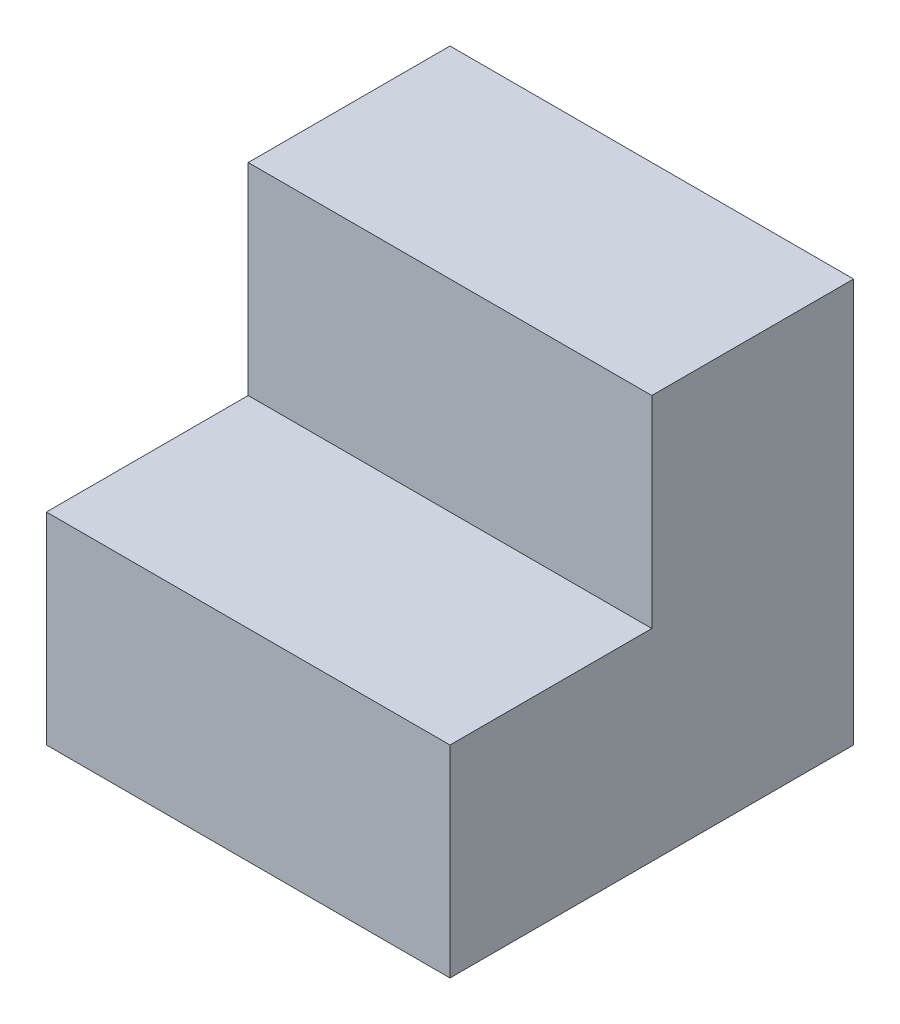
ISO-10303-21;
HEADER;
FILE_DESCRIPTION(('STEP AP214'),'2;1');
FILE_NAME('part.step','',(''),(''),'','','');
FILE_SCHEMA(('AUTOMOTIVE_DESIGN { 1 0 10303 214 1 1 1 1 }'));
ENDSEC;
DATA;
#1=APPLICATION_CONTEXT('core data for automotive mechanical design processes');
#2=APPLICATION_PROTOCOL_DEFINITION('international standard','automotive_design',2000,#1);
#3=PRODUCT_CONTEXT('',#1,'mechanical');
#4=PRODUCT('Part','Part','',(#3));
#5=PRODUCT_RELATED_PRODUCT_CATEGORY('part','',(#4));
#6=PRODUCT_DEFINITION_FORMATION('','',#4);
#7=PRODUCT_DEFINITION_CONTEXT('part definition',#1,'design');
#8=PRODUCT_DEFINITION('design','',#6,#7);
#9=PRODUCT_DEFINITION_SHAPE('','',#8);
#10=(LENGTH_UNIT() NAMED_UNIT(*) SI_UNIT(.MILLI.,.METRE.));
#11=(NAMED_UNIT(*) PLANE_ANGLE_UNIT() SI_UNIT($,.RADIAN.));
#12=(NAMED_UNIT(*) SI_UNIT($,.STERADIAN.) SOLID_ANGLE_UNIT());
#13=UNCERTAINTY_MEASURE_WITH_UNIT(LENGTH_MEASURE(1.E-05),#10,'distance_accuracy_value','');
#14=(GEOMETRIC_REPRESENTATION_CONTEXT(3) GLOBAL_UNCERTAINTY_ASSIGNED_CONTEXT((#13)) GLOBAL_UNIT_ASSIGNED_CONTEXT((#10,
#11,#12)) REPRESENTATION_CONTEXT('',''));
#15=CARTESIAN_POINT('',(0.,0.,0.));
#16=DIRECTION('',(0.,0.,1.));
#17=DIRECTION('',(1.,0.,0.));
#18=AXIS2_PLACEMENT_3D('',#15,#16,#17);
#19=CARTESIAN_POINT('',(0.5,0.,0.499999999999997));
#20=DIRECTION('',(0.,-1.,0.));
#21=DIRECTION('',(0.,0.,-1.));
#22=AXIS2_PLACEMENT_3D('',#19,#20,#21);
#23=PLANE('',#22);
#24=DIRECTION('',(0.,0.,1.));
#25=VECTOR('',#24,1.);
#26=CARTESIAN_POINT('',(-0.5,0.,0.499999999999997));
#27=LINE('',#26,#25);
#28=CARTESIAN_POINT('',(-0.5,0.,0.));
#29=VERTEX_POINT('',#28);
#30=CARTESIAN_POINT('',(-0.5,0.,0.499999999999997));
#31=VERTEX_POINT('',#30);
#32=EDGE_CURVE('E119',#29,#31,#27,.T.);
#33=ORIENTED_EDGE('',*,*,#32,.T.);
#34=DIRECTION('',(-1.,0.,0.));
#35=VECTOR('',#34,1.);
#36=CARTESIAN_POINT('',(0.5,0.,0.499999999999997));
#37=LINE('',#36,#35);
#38=CARTESIAN_POINT('',(0.5,0.,0.499999999999997));
#39=VERTEX_POINT('',#38);
#40=EDGE_CURVE('E11',#39,#31,#37,.T.);
#41=ORIENTED_EDGE('',*,*,#40,.F.);
#42=DIRECTION('',(0.,0.,1.));
#43=VECTOR('',#42,1.);
#44=CARTESIAN_POINT('',(0.5,0.,0.499999999999997));
#45=LINE('',#44,#43);
#46=CARTESIAN_POINT('',(0.5,0.,0.));
#47=VERTEX_POINT('',#46);
#48=EDGE_CURVE('E129',#47,#39,#45,.T.);
#49=ORIENTED_EDGE('',*,*,#48,.F.);
#50=DIRECTION('',(-1.,0.,0.));
#51=VECTOR('',#50,1.);
#52=CARTESIAN_POINT('',(0.5,0.,0.));
#53=LINE('',#52,#51);
#54=EDGE_CURVE('E115',#47,#29,#53,.T.);
#55=ORIENTED_EDGE('',*,*,#54,.T.);
#56=EDGE_LOOP('',(#33,#41,#49,#55));
#57=FACE_BOUND('',#56,.T.);
#58=ADVANCED_FACE('F35',(#57),#23,.F.);
#59=CARTESIAN_POINT('',(0.5,-0.5,0.499999999999997));
#60=DIRECTION('',(0.,0.,-1.));
#61=DIRECTION('',(-1.,0.,0.));
#62=AXIS2_PLACEMENT_3D('',#59,#60,#61);
#63=PLANE('',#62);
#64=DIRECTION('',(0.,-1.,0.));
#65=VECTOR('',#64,1.);
#66=CARTESIAN_POINT('',(-0.5,-0.5,0.499999999999997));
#67=LINE('',#66,#65);
#68=CARTESIAN_POINT('',(-0.5,-0.5,0.499999999999997));
#69=VERTEX_POINT('',#68);
#70=EDGE_CURVE('E122',#31,#69,#67,.T.);
#71=ORIENTED_EDGE('',*,*,#70,.T.);
#72=DIRECTION('',(-1.,0.,0.));
#73=VECTOR('',#72,1.);
#74=CARTESIAN_POINT('',(0.5,-0.5,0.499999999999997));
#75=LINE('',#74,#73);
#76=CARTESIAN_POINT('',(0.5,-0.5,0.499999999999997));
#77=VERTEX_POINT('',#76);
#78=EDGE_CURVE('E43',#77,#69,#75,.T.);
#79=ORIENTED_EDGE('',*,*,#78,.F.);
#80=DIRECTION('',(0.,-1.,0.));
#81=VECTOR('',#80,1.);
#82=CARTESIAN_POINT('',(0.5,-0.5,0.499999999999997));
#83=LINE('',#82,#81);
#84=EDGE_CURVE('E88',#39,#77,#83,.T.);
#85=ORIENTED_EDGE('',*,*,#84,.F.);
#86=ORIENTED_EDGE('',*,*,#40,.T.);
#87=EDGE_LOOP('',(#71,#79,#85,#86));
#88=FACE_BOUND('',#87,.T.);
#89=ADVANCED_FACE('F153',(#88),#63,.F.);
#90=CARTESIAN_POINT('',(0.5,-0.499999999999997,-0.5));
#91=DIRECTION('',(0.,1.,0.));
#92=DIRECTION('',(0.,0.,1.));
#93=AXIS2_PLACEMENT_3D('',#90,#91,#92);
#94=PLANE('',#93);
#95=DIRECTION('',(0.,0.,-1.));
#96=VECTOR('',#95,1.);
#97=CARTESIAN_POINT('',(-0.5,-0.499999999999997,-0.5));
#98=LINE('',#97,#96);
#99=CARTESIAN_POINT('',(-0.5,-0.499999999999997,-0.5));
#100=VERTEX_POINT('',#99);
#101=EDGE_CURVE('E124',#69,#100,#98,.T.);
#102=ORIENTED_EDGE('',*,*,#101,.T.);
#103=DIRECTION('',(-1.,0.,0.));
#104=VECTOR('',#103,1.);
#105=CARTESIAN_POINT('',(0.5,-0.499999999999997,-0.5));
#106=LINE('',#105,#104);
#107=CARTESIAN_POINT('',(0.5,-0.499999999999997,-0.5));
#108=VERTEX_POINT('',#107);
#109=EDGE_CURVE('E110',#108,#100,#106,.T.);
#110=ORIENTED_EDGE('',*,*,#109,.F.);
#111=DIRECTION('',(0.,0.,-1.));
#112=VECTOR('',#111,1.);
#113=CARTESIAN_POINT('',(0.5,-0.499999999999997,-0.5));
#114=LINE('',#113,#112);
#115=EDGE_CURVE('E101',#77,#108,#114,.T.);
#116=ORIENTED_EDGE('',*,*,#115,.F.);
#117=ORIENTED_EDGE('',*,*,#78,.T.);
#118=EDGE_LOOP('',(#102,#110,#116,#117));
#119=FACE_BOUND('',#118,.T.);
#120=ADVANCED_FACE('F135',(#119),#94,.F.);
#121=CARTESIAN_POINT('',(0.5,0.500000000000004,-0.5));
#122=DIRECTION('',(0.,0.,1.));
#123=DIRECTION('',(1.,0.,0.));
#124=AXIS2_PLACEMENT_3D('',#121,#122,#123);
#125=PLANE('',#124);
#126=DIRECTION('',(0.,1.,0.));
#127=VECTOR('',#126,1.);
#128=CARTESIAN_POINT('',(-0.5,0.500000000000004,-0.5));
#129=LINE('',#128,#127);
#130=CARTESIAN_POINT('',(-0.5,0.500000000000004,-0.5));
#131=VERTEX_POINT('',#130);
#132=EDGE_CURVE('E109',#100,#131,#129,.T.);
#133=ORIENTED_EDGE('',*,*,#132,.T.);
#134=DIRECTION('',(-1.,0.,0.));
#135=VECTOR('',#134,1.);
#136=CARTESIAN_POINT('',(0.5,0.500000000000004,-0.5));
#137=LINE('',#136,#135);
#138=CARTESIAN_POINT('',(0.5,0.500000000000004,-0.5));
#139=VERTEX_POINT('',#138);
#140=EDGE_CURVE('E106',#139,#131,#137,.T.);
#141=ORIENTED_EDGE('',*,*,#140,.F.);
#142=DIRECTION('',(0.,1.,0.));
#143=VECTOR('',#142,1.);
#144=CARTESIAN_POINT('',(0.5,0.500000000000004,-0.5));
#145=LINE('',#144,#143);
#146=EDGE_CURVE('E95',#108,#139,#145,.T.);
#147=ORIENTED_EDGE('',*,*,#146,.F.);
#148=ORIENTED_EDGE('',*,*,#109,.T.);
#149=EDGE_LOOP('',(#133,#141,#147,#148));
#150=FACE_BOUND('',#149,.T.);
#151=ADVANCED_FACE('F107',(#150),#125,.F.);
#152=CARTESIAN_POINT('',(0.5,0.500000000000004,0.));
#153=DIRECTION('',(0.,-1.,0.));
#154=DIRECTION('',(0.,0.,-1.));
#155=AXIS2_PLACEMENT_3D('',#152,#153,#154);
#156=PLANE('',#155);
#157=DIRECTION('',(0.,0.,1.));
#158=VECTOR('',#157,1.);
#159=CARTESIAN_POINT('',(-0.5,0.500000000000004,0.));
#160=LINE('',#159,#158);
#161=CARTESIAN_POINT('',(-0.5,0.500000000000004,0.));
#162=VERTEX_POINT('',#161);
#163=EDGE_CURVE('E74',#131,#162,#160,.T.);
#164=ORIENTED_EDGE('',*,*,#163,.T.);
#165=DIRECTION('',(-1.,0.,0.));
#166=VECTOR('',#165,1.);
#167=CARTESIAN_POINT('',(0.5,0.500000000000004,0.));
#168=LINE('',#167,#166);
#169=CARTESIAN_POINT('',(0.5,0.500000000000004,0.));
#170=VERTEX_POINT('',#169);
#171=EDGE_CURVE('E111',#170,#162,#168,.T.);
#172=ORIENTED_EDGE('',*,*,#171,.F.);
#173=DIRECTION('',(0.,0.,1.));
#174=VECTOR('',#173,1.);
#175=CARTESIAN_POINT('',(0.5,0.500000000000004,0.));
#176=LINE('',#175,#174);
#177=EDGE_CURVE('E99',#139,#170,#176,.T.);
#178=ORIENTED_EDGE('',*,*,#177,.F.);
#179=ORIENTED_EDGE('',*,*,#140,.T.);
#180=EDGE_LOOP('',(#164,#172,#178,#179));
#181=FACE_BOUND('',#180,.T.);
#182=ADVANCED_FACE('F113',(#181),#156,.F.);
#183=CARTESIAN_POINT('',(0.5,0.,0.));
#184=DIRECTION('',(0.,0.,-1.));
#185=DIRECTION('',(-1.,0.,0.));
#186=AXIS2_PLACEMENT_3D('',#183,#184,#185);
#187=PLANE('',#186);
#188=DIRECTION('',(0.,-1.,0.));
#189=VECTOR('',#188,1.);
#190=CARTESIAN_POINT('',(-0.5,0.,0.));
#191=LINE('',#190,#189);
#192=EDGE_CURVE('E80',#162,#29,#191,.T.);
#193=ORIENTED_EDGE('',*,*,#192,.T.);
#194=ORIENTED_EDGE('',*,*,#54,.F.);
#195=DIRECTION('',(0.,-1.,0.));
#196=VECTOR('',#195,1.);
#197=CARTESIAN_POINT('',(0.5,0.,0.));
#198=LINE('',#197,#196);
#199=EDGE_CURVE('E51',#170,#47,#198,.T.);
#200=ORIENTED_EDGE('',*,*,#199,.F.);
#201=ORIENTED_EDGE('',*,*,#171,.T.);
#202=EDGE_LOOP('',(#193,#194,#200,#201));
#203=FACE_BOUND('',#202,.T.);
#204=ADVANCED_FACE('F142',(#203),#187,.F.);
#205=CARTESIAN_POINT('',(0.5,0.,0.));
#206=DIRECTION('',(1.,0.,0.));
#207=DIRECTION('',(0.,0.,-1.));
#208=AXIS2_PLACEMENT_3D('',#205,#206,#207);
#209=PLANE('',#208);
#210=ORIENTED_EDGE('',*,*,#48,.T.);
#211=ORIENTED_EDGE('',*,*,#84,.T.);
#212=ORIENTED_EDGE('',*,*,#115,.T.);
#213=ORIENTED_EDGE('',*,*,#146,.T.);
#214=ORIENTED_EDGE('',*,*,#177,.T.);
#215=ORIENTED_EDGE('',*,*,#199,.T.);
#216=EDGE_LOOP('',(#210,#211,#212,#213,#214,#215));
#217=FACE_BOUND('',#216,.T.);
#218=ADVANCED_FACE('F97',(#217),#209,.T.);
#219=CARTESIAN_POINT('',(-0.5,0.,0.));
#220=DIRECTION('',(1.,0.,0.));
#221=DIRECTION('',(0.,0.,-1.));
#222=AXIS2_PLACEMENT_3D('',#219,#220,#221);
#223=PLANE('',#222);
#224=ORIENTED_EDGE('',*,*,#32,.F.);
#225=ORIENTED_EDGE('',*,*,#192,.F.);
#226=ORIENTED_EDGE('',*,*,#163,.F.);
#227=ORIENTED_EDGE('',*,*,#132,.F.);
#228=ORIENTED_EDGE('',*,*,#101,.F.);
#229=ORIENTED_EDGE('',*,*,#70,.F.);
#230=EDGE_LOOP('',(#224,#225,#226,#227,#228,#229));
#231=FACE_BOUND('',#230,.T.);
#232=ADVANCED_FACE('F138',(#231),#223,.F.);
#233=CLOSED_SHELL('',(#58,#89,#120,#151,#182,#204,#218,#232));
#234=MANIFOLD_SOLID_BREP('B2',#233);
#235=ADVANCED_BREP_SHAPE_REPRESENTATION('',(#18,#234),#14);
#236=SHAPE_DEFINITION_REPRESENTATION(#9,#235);
ENDSEC;
END-ISO-10303-21;
